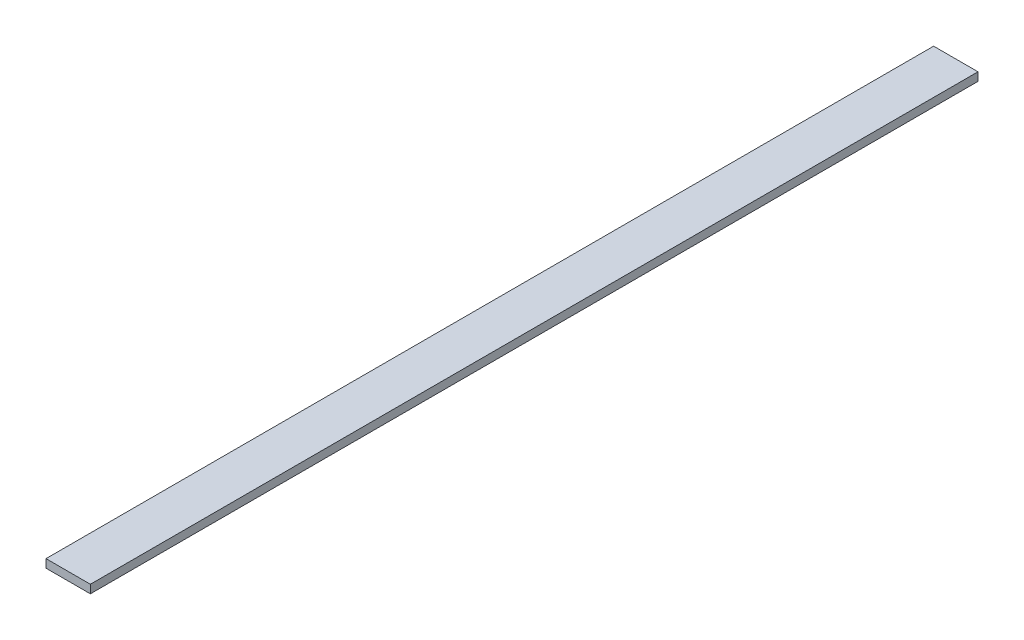
ISO-10303-21;
HEADER;
FILE_DESCRIPTION(('STEP AP214'),'2;1');
FILE_NAME('part.step','',(''),(''),'','','');
FILE_SCHEMA(('AUTOMOTIVE_DESIGN { 1 0 10303 214 1 1 1 1 }'));
ENDSEC;
DATA;
#1=APPLICATION_CONTEXT('core data for automotive mechanical design processes');
#2=APPLICATION_PROTOCOL_DEFINITION('international standard','automotive_design',2000,#1);
#3=PRODUCT_CONTEXT('',#1,'mechanical');
#4=PRODUCT('Part','Part','',(#3));
#5=PRODUCT_RELATED_PRODUCT_CATEGORY('part','',(#4));
#6=PRODUCT_DEFINITION_FORMATION('','',#4);
#7=PRODUCT_DEFINITION_CONTEXT('part definition',#1,'design');
#8=PRODUCT_DEFINITION('design','',#6,#7);
#9=PRODUCT_DEFINITION_SHAPE('','',#8);
#10=(LENGTH_UNIT() NAMED_UNIT(*) SI_UNIT(.MILLI.,.METRE.));
#11=(NAMED_UNIT(*) PLANE_ANGLE_UNIT() SI_UNIT($,.RADIAN.));
#12=(NAMED_UNIT(*) SI_UNIT($,.STERADIAN.) SOLID_ANGLE_UNIT());
#13=UNCERTAINTY_MEASURE_WITH_UNIT(LENGTH_MEASURE(1.E-05),#10,'distance_accuracy_value','');
#14=(GEOMETRIC_REPRESENTATION_CONTEXT(3) GLOBAL_UNCERTAINTY_ASSIGNED_CONTEXT((#13)) GLOBAL_UNIT_ASSIGNED_CONTEXT((#10,
#11,#12)) REPRESENTATION_CONTEXT('',''));
#15=CARTESIAN_POINT('',(0.,0.,0.));
#16=DIRECTION('',(0.,0.,1.));
#17=DIRECTION('',(1.,0.,0.));
#18=AXIS2_PLACEMENT_3D('',#15,#16,#17);
#19=CARTESIAN_POINT('',(101.6,19.05,0.));
#20=DIRECTION('',(0.,1.,0.));
#21=DIRECTION('',(0.,0.,1.));
#22=AXIS2_PLACEMENT_3D('',#19,#20,#21);
#23=PLANE('',#22);
#24=DIRECTION('',(0.,0.,-1.));
#25=VECTOR('',#24,1.);
#26=CARTESIAN_POINT('',(101.6,19.05,0.));
#27=LINE('',#26,#25);
#28=CARTESIAN_POINT('',(101.6,19.05,0.));
#29=VERTEX_POINT('',#28);
#30=CARTESIAN_POINT('',(101.6,19.05,2032.));
#31=VERTEX_POINT('',#30);
#32=EDGE_CURVE('E19',#29,#31,#27,.F.);
#33=ORIENTED_EDGE('',*,*,#32,.F.);
#34=DIRECTION('',(1.,0.,0.));
#35=VECTOR('',#34,1.);
#36=CARTESIAN_POINT('',(0.,19.05,0.));
#37=LINE('',#36,#35);
#38=CARTESIAN_POINT('',(0.,19.05,0.));
#39=VERTEX_POINT('',#38);
#40=EDGE_CURVE('E79',#29,#39,#37,.F.);
#41=ORIENTED_EDGE('',*,*,#40,.T.);
#42=DIRECTION('',(0.,0.,1.));
#43=VECTOR('',#42,1.);
#44=CARTESIAN_POINT('',(0.,19.05,0.));
#45=LINE('',#44,#43);
#46=CARTESIAN_POINT('',(0.,19.05,2032.));
#47=VERTEX_POINT('',#46);
#48=EDGE_CURVE('E67',#47,#39,#45,.F.);
#49=ORIENTED_EDGE('',*,*,#48,.F.);
#50=DIRECTION('',(1.,0.,0.));
#51=VECTOR('',#50,1.);
#52=CARTESIAN_POINT('',(0.,19.05,2032.));
#53=LINE('',#52,#51);
#54=EDGE_CURVE('E55',#31,#47,#53,.F.);
#55=ORIENTED_EDGE('',*,*,#54,.F.);
#56=EDGE_LOOP('',(#33,#41,#49,#55));
#57=FACE_BOUND('',#56,.T.);
#58=ADVANCED_FACE('F16',(#57),#23,.T.);
#59=CARTESIAN_POINT('',(101.6,0.,0.));
#60=DIRECTION('',(1.,0.,0.));
#61=DIRECTION('',(0.,0.,-1.));
#62=AXIS2_PLACEMENT_3D('',#59,#60,#61);
#63=PLANE('',#62);
#64=DIRECTION('',(0.,0.,-1.));
#65=VECTOR('',#64,1.);
#66=CARTESIAN_POINT('',(101.6,0.,0.));
#67=LINE('',#66,#65);
#68=CARTESIAN_POINT('',(101.6,0.,0.));
#69=VERTEX_POINT('',#68);
#70=CARTESIAN_POINT('',(101.6,0.,2032.));
#71=VERTEX_POINT('',#70);
#72=EDGE_CURVE('E82',#69,#71,#67,.F.);
#73=ORIENTED_EDGE('',*,*,#72,.F.);
#74=DIRECTION('',(0.,1.,0.));
#75=VECTOR('',#74,1.);
#76=CARTESIAN_POINT('',(101.6,0.,0.));
#77=LINE('',#76,#75);
#78=EDGE_CURVE('E64',#69,#29,#77,.T.);
#79=ORIENTED_EDGE('',*,*,#78,.T.);
#80=ORIENTED_EDGE('',*,*,#32,.T.);
#81=DIRECTION('',(0.,1.,0.));
#82=VECTOR('',#81,1.);
#83=CARTESIAN_POINT('',(101.6,0.,2032.));
#84=LINE('',#83,#82);
#85=EDGE_CURVE('E61',#71,#31,#84,.T.);
#86=ORIENTED_EDGE('',*,*,#85,.F.);
#87=EDGE_LOOP('',(#73,#79,#80,#86));
#88=FACE_BOUND('',#87,.T.);
#89=ADVANCED_FACE('F60',(#88),#63,.T.);
#90=CARTESIAN_POINT('',(0.,0.,2032.));
#91=DIRECTION('',(0.,0.,1.));
#92=DIRECTION('',(1.,0.,0.));
#93=AXIS2_PLACEMENT_3D('',#90,#91,#92);
#94=PLANE('',#93);
#95=DIRECTION('',(0.,1.,0.));
#96=VECTOR('',#95,1.);
#97=CARTESIAN_POINT('',(0.,19.05,2032.));
#98=LINE('',#97,#96);
#99=CARTESIAN_POINT('',(0.,0.,2032.));
#100=VERTEX_POINT('',#99);
#101=EDGE_CURVE('E69',#100,#47,#98,.T.);
#102=ORIENTED_EDGE('',*,*,#101,.F.);
#103=DIRECTION('',(1.,0.,0.));
#104=VECTOR('',#103,1.);
#105=CARTESIAN_POINT('',(0.,0.,2032.));
#106=LINE('',#105,#104);
#107=EDGE_CURVE('E73',#71,#100,#106,.F.);
#108=ORIENTED_EDGE('',*,*,#107,.F.);
#109=ORIENTED_EDGE('',*,*,#85,.T.);
#110=ORIENTED_EDGE('',*,*,#54,.T.);
#111=EDGE_LOOP('',(#102,#108,#109,#110));
#112=FACE_BOUND('',#111,.T.);
#113=ADVANCED_FACE('F71',(#112),#94,.T.);
#114=CARTESIAN_POINT('',(0.,19.05,0.));
#115=DIRECTION('',(-1.,0.,0.));
#116=DIRECTION('',(0.,0.,1.));
#117=AXIS2_PLACEMENT_3D('',#114,#115,#116);
#118=PLANE('',#117);
#119=ORIENTED_EDGE('',*,*,#48,.T.);
#120=DIRECTION('',(0.,1.,0.));
#121=VECTOR('',#120,1.);
#122=CARTESIAN_POINT('',(0.,0.,0.));
#123=LINE('',#122,#121);
#124=CARTESIAN_POINT('',(0.,0.,0.));
#125=VERTEX_POINT('',#124);
#126=EDGE_CURVE('E34',#39,#125,#123,.F.);
#127=ORIENTED_EDGE('',*,*,#126,.T.);
#128=DIRECTION('',(0.,0.,-1.));
#129=VECTOR('',#128,1.);
#130=CARTESIAN_POINT('',(0.,0.,0.));
#131=LINE('',#130,#129);
#132=EDGE_CURVE('E25',#100,#125,#131,.T.);
#133=ORIENTED_EDGE('',*,*,#132,.F.);
#134=ORIENTED_EDGE('',*,*,#101,.T.);
#135=EDGE_LOOP('',(#119,#127,#133,#134));
#136=FACE_BOUND('',#135,.T.);
#137=ADVANCED_FACE('F88',(#136),#118,.T.);
#138=CARTESIAN_POINT('',(0.,0.,0.));
#139=DIRECTION('',(0.,0.,1.));
#140=DIRECTION('',(1.,0.,0.));
#141=AXIS2_PLACEMENT_3D('',#138,#139,#140);
#142=PLANE('',#141);
#143=ORIENTED_EDGE('',*,*,#40,.F.);
#144=ORIENTED_EDGE('',*,*,#78,.F.);
#145=DIRECTION('',(1.,0.,0.));
#146=VECTOR('',#145,1.);
#147=CARTESIAN_POINT('',(0.,0.,0.));
#148=LINE('',#147,#146);
#149=EDGE_CURVE('E11',#125,#69,#148,.T.);
#150=ORIENTED_EDGE('',*,*,#149,.F.);
#151=ORIENTED_EDGE('',*,*,#126,.F.);
#152=EDGE_LOOP('',(#143,#144,#150,#151));
#153=FACE_BOUND('',#152,.T.);
#154=ADVANCED_FACE('F90',(#153),#142,.F.);
#155=CARTESIAN_POINT('',(0.,0.,0.));
#156=DIRECTION('',(0.,-1.,0.));
#157=DIRECTION('',(0.,0.,-1.));
#158=AXIS2_PLACEMENT_3D('',#155,#156,#157);
#159=PLANE('',#158);
#160=ORIENTED_EDGE('',*,*,#132,.T.);
#161=ORIENTED_EDGE('',*,*,#149,.T.);
#162=ORIENTED_EDGE('',*,*,#72,.T.);
#163=ORIENTED_EDGE('',*,*,#107,.T.);
#164=EDGE_LOOP('',(#160,#161,#162,#163));
#165=FACE_BOUND('',#164,.T.);
#166=ADVANCED_FACE('F87',(#165),#159,.T.);
#167=CLOSED_SHELL('',(#58,#89,#113,#137,#154,#166));
#168=MANIFOLD_SOLID_BREP('B1',#167);
#169=ADVANCED_BREP_SHAPE_REPRESENTATION('',(#18,#168),#14);
#170=SHAPE_DEFINITION_REPRESENTATION(#9,#169);
ENDSEC;
END-ISO-10303-21;
